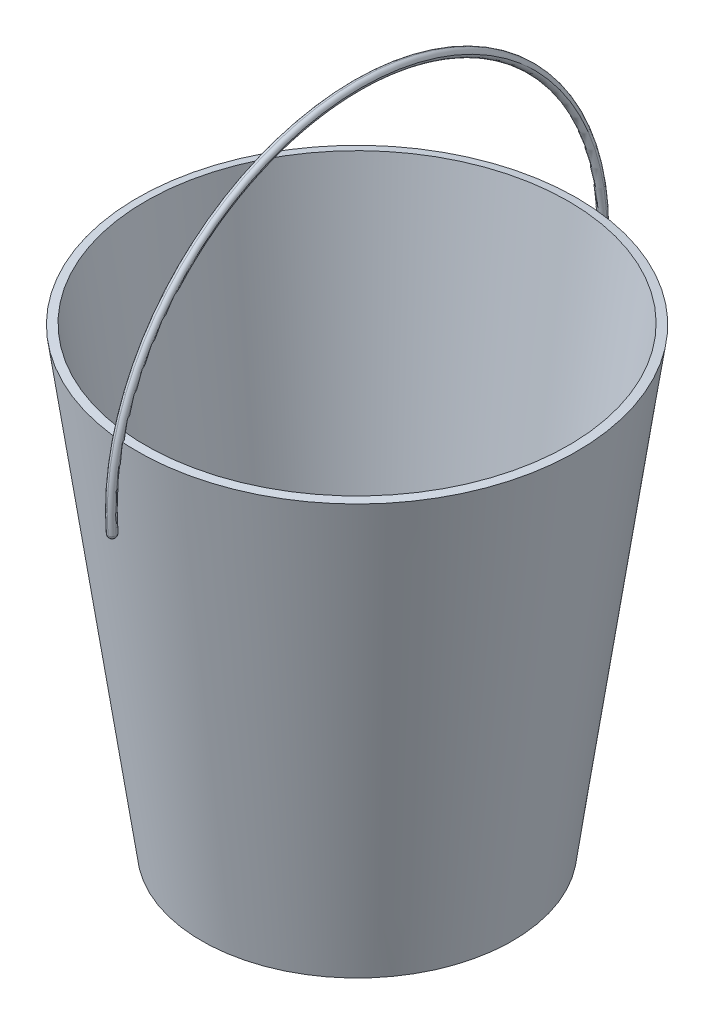
ISO-10303-21;
HEADER;
FILE_DESCRIPTION(('STEP AP214'),'2;1');
FILE_NAME('part.step','',(''),(''),'','','');
FILE_SCHEMA(('AUTOMOTIVE_DESIGN { 1 0 10303 214 1 1 1 1 }'));
ENDSEC;
DATA;
#1=APPLICATION_CONTEXT('core data for automotive mechanical design processes');
#2=APPLICATION_PROTOCOL_DEFINITION('international standard','automotive_design',2000,#1);
#3=PRODUCT_CONTEXT('',#1,'mechanical');
#4=PRODUCT('Part','Part','',(#3));
#5=PRODUCT_RELATED_PRODUCT_CATEGORY('part','',(#4));
#6=PRODUCT_DEFINITION_FORMATION('','',#4);
#7=PRODUCT_DEFINITION_CONTEXT('part definition',#1,'design');
#8=PRODUCT_DEFINITION('design','',#6,#7);
#9=PRODUCT_DEFINITION_SHAPE('','',#8);
#10=(LENGTH_UNIT() NAMED_UNIT(*) SI_UNIT(.MILLI.,.METRE.));
#11=(NAMED_UNIT(*) PLANE_ANGLE_UNIT() SI_UNIT($,.RADIAN.));
#12=(NAMED_UNIT(*) SI_UNIT($,.STERADIAN.) SOLID_ANGLE_UNIT());
#13=UNCERTAINTY_MEASURE_WITH_UNIT(LENGTH_MEASURE(1.E-05),#10,'distance_accuracy_value','');
#14=(GEOMETRIC_REPRESENTATION_CONTEXT(3) GLOBAL_UNCERTAINTY_ASSIGNED_CONTEXT((#13)) GLOBAL_UNIT_ASSIGNED_CONTEXT((#10,
#11,#12)) REPRESENTATION_CONTEXT('',''));
#15=CARTESIAN_POINT('',(0.,0.,0.));
#16=DIRECTION('',(0.,0.,1.));
#17=DIRECTION('',(1.,0.,0.));
#18=AXIS2_PLACEMENT_3D('',#15,#16,#17);
#19=CARTESIAN_POINT('',(0.,95.996142755768,-59.088151966747));
#20=DIRECTION('',(0.,0.,1.));
#21=DIRECTION('',(1.,0.,0.));
#22=AXIS2_PLACEMENT_3D('',#19,#20,#21);
#23=SPHERICAL_SURFACE('',#22,1.);
#24=CARTESIAN_POINT('',(0.,95.996142755768,-59.088151966747));
#25=DIRECTION('',(0.,-0.0965481443031342,-0.995328315598236));
#26=DIRECTION('',(0.,0.995328315598236,-0.0965481443031342));
#27=AXIS2_PLACEMENT_3D('',#24,#25,#26);
#28=CIRCLE('',#27,1.);
#29=CARTESIAN_POINT('',(0.,95.0008144401697,-58.9916038224438));
#30=VERTEX_POINT('',#29);
#31=CARTESIAN_POINT('',(1.,95.996142755768,-59.088151966747));
#32=VERTEX_POINT('',#31);
#33=EDGE_CURVE('E12',#30,#32,#28,.F.);
#34=ORIENTED_EDGE('',*,*,#33,.F.);
#35=CARTESIAN_POINT('',(0.,95.996142755768,-59.088151966747));
#36=DIRECTION('',(-1.,0.,0.));
#37=DIRECTION('',(0.,0.,1.));
#38=AXIS2_PLACEMENT_3D('',#35,#36,#37);
#39=CIRCLE('',#38,1.);
#40=CARTESIAN_POINT('',(0.,95.9163995113156,-60.0849674035076));
#41=VERTEX_POINT('',#40);
#42=EDGE_CURVE('E52',#41,#30,#39,.T.);
#43=ORIENTED_EDGE('',*,*,#42,.F.);
#44=CARTESIAN_POINT('',(0.,95.996142755768,-59.088151966747));
#45=DIRECTION('',(0.,-0.99681543676059,0.0797432444523959));
#46=DIRECTION('',(0.,-0.0797432444523959,-0.99681543676059));
#47=AXIS2_PLACEMENT_3D('',#44,#45,#46);
#48=CIRCLE('',#47,1.);
#49=EDGE_CURVE('E162',#32,#41,#48,.F.);
#50=ORIENTED_EDGE('',*,*,#49,.F.);
#51=EDGE_LOOP('',(#34,#43,#50));
#52=FACE_BOUND('',#51,.T.);
#53=ADVANCED_FACE('F44',(#52),#23,.T.);
#54=CARTESIAN_POINT('',(0.,95.9961427557679,59.088151966747));
#55=DIRECTION('',(0.,0.,1.));
#56=DIRECTION('',(1.,0.,0.));
#57=AXIS2_PLACEMENT_3D('',#54,#55,#56);
#58=SPHERICAL_SURFACE('',#57,1.);
#59=CARTESIAN_POINT('',(0.,95.9961427557679,59.088151966747));
#60=DIRECTION('',(0.,-0.996815436760591,-0.0797432444523821));
#61=DIRECTION('',(0.,0.0797432444523821,-0.996815436760591));
#62=AXIS2_PLACEMENT_3D('',#59,#60,#61);
#63=CIRCLE('',#62,1.);
#64=CARTESIAN_POINT('',(0.,95.9163995113156,60.0849674035076));
#65=VERTEX_POINT('',#64);
#66=CARTESIAN_POINT('',(1.,95.9961427557679,59.088151966747));
#67=VERTEX_POINT('',#66);
#68=EDGE_CURVE('E165',#65,#67,#63,.F.);
#69=ORIENTED_EDGE('',*,*,#68,.F.);
#70=CARTESIAN_POINT('',(0.,95.9961427557679,59.088151966747));
#71=DIRECTION('',(-1.,0.,0.));
#72=DIRECTION('',(0.,0.,1.));
#73=AXIS2_PLACEMENT_3D('',#70,#71,#72);
#74=CIRCLE('',#73,1.);
#75=CARTESIAN_POINT('',(0.,95.0008144401697,58.9916038224438));
#76=VERTEX_POINT('',#75);
#77=EDGE_CURVE('E140',#76,#65,#74,.T.);
#78=ORIENTED_EDGE('',*,*,#77,.F.);
#79=CARTESIAN_POINT('',(0.,95.9961427557679,59.088151966747));
#80=DIRECTION('',(0.,-0.0965481443031411,0.995328315598235));
#81=DIRECTION('',(0.,-0.995328315598235,-0.0965481443031411));
#82=AXIS2_PLACEMENT_3D('',#79,#80,#81);
#83=CIRCLE('',#82,1.);
#84=EDGE_CURVE('E123',#67,#76,#83,.F.);
#85=ORIENTED_EDGE('',*,*,#84,.F.);
#86=EDGE_LOOP('',(#69,#78,#85));
#87=FACE_BOUND('',#86,.T.);
#88=ADVANCED_FACE('F193',(#87),#58,.T.);
#89=CARTESIAN_POINT('',(0.,95.996142755768,-59.088151966747));
#90=DIRECTION('',(0.,0.,1.));
#91=DIRECTION('',(1.,0.,0.));
#92=AXIS2_PLACEMENT_3D('',#89,#90,#91);
#93=SPHERICAL_SURFACE('',#92,1.);
#94=ORIENTED_EDGE('',*,*,#42,.T.);
#95=CARTESIAN_POINT('',(0.,95.996142755768,-59.088151966747));
#96=DIRECTION('',(0.,0.0965481443031479,0.995328315598234));
#97=DIRECTION('',(0.,-0.995328315598235,0.096548144303148));
#98=AXIS2_PLACEMENT_3D('',#95,#96,#97);
#99=CIRCLE('',#98,1.);
#100=CARTESIAN_POINT('',(-1.,95.996142755768,-59.088151966747));
#101=VERTEX_POINT('',#100);
#102=EDGE_CURVE('E155',#101,#30,#99,.T.);
#103=ORIENTED_EDGE('',*,*,#102,.F.);
#104=CARTESIAN_POINT('',(0.,95.996142755768,-59.088151966747));
#105=DIRECTION('',(0.,-0.996815436760591,0.0797432444523821));
#106=DIRECTION('',(0.,-0.0797432444523821,-0.996815436760591));
#107=AXIS2_PLACEMENT_3D('',#104,#105,#106);
#108=CIRCLE('',#107,1.);
#109=EDGE_CURVE('E151',#41,#101,#108,.F.);
#110=ORIENTED_EDGE('',*,*,#109,.F.);
#111=EDGE_LOOP('',(#94,#103,#110));
#112=FACE_BOUND('',#111,.T.);
#113=ADVANCED_FACE('F170',(#112),#93,.T.);
#114=CARTESIAN_POINT('',(0.,100.723076923077,0.));
#115=DIRECTION('',(1.,0.,0.));
#116=DIRECTION('',(0.,0.,-1.));
#117=AXIS2_PLACEMENT_3D('',#114,#115,#116);
#118=TOROIDAL_SURFACE('',#117,59.2769230769231,1.);
#119=CARTESIAN_POINT('',(1.,100.723076923077,0.));
#120=DIRECTION('',(1.,0.,0.));
#121=DIRECTION('',(0.,0.,-1.));
#122=AXIS2_PLACEMENT_3D('',#119,#120,#121);
#123=CIRCLE('',#122,59.2769230769231);
#124=EDGE_CURVE('E107',#32,#67,#123,.T.);
#125=ORIENTED_EDGE('',*,*,#124,.F.);
#126=ORIENTED_EDGE('',*,*,#49,.T.);
#127=CARTESIAN_POINT('',(0.,100.723076923077,0.));
#128=DIRECTION('',(1.,0.,0.));
#129=DIRECTION('',(0.,0.,-1.));
#130=AXIS2_PLACEMENT_3D('',#127,#128,#129);
#131=CIRCLE('',#130,60.2769230769231);
#132=EDGE_CURVE('E147',#65,#41,#131,.F.);
#133=ORIENTED_EDGE('',*,*,#132,.F.);
#134=ORIENTED_EDGE('',*,*,#68,.T.);
#135=EDGE_LOOP('',(#125,#126,#133,#134));
#136=FACE_BOUND('',#135,.T.);
#137=ADVANCED_FACE('F177',(#136),#118,.T.);
#138=CARTESIAN_POINT('',(0.,95.996142755768,-59.088151966747));
#139=DIRECTION('',(0.,0.,1.));
#140=DIRECTION('',(1.,0.,0.));
#141=AXIS2_PLACEMENT_3D('',#138,#139,#140);
#142=SPHERICAL_SURFACE('',#141,1.);
#143=CARTESIAN_POINT('',(0.,95.996142755768,-59.088151966747));
#144=DIRECTION('',(1.,0.,0.));
#145=DIRECTION('',(0.,0.,-1.));
#146=AXIS2_PLACEMENT_3D('',#143,#144,#145);
#147=CIRCLE('',#146,1.);
#148=CARTESIAN_POINT('',(0.,96.0758860002204,-58.0913365299864));
#149=VERTEX_POINT('',#148);
#150=EDGE_CURVE('E159',#149,#30,#147,.T.);
#151=ORIENTED_EDGE('',*,*,#150,.T.);
#152=ORIENTED_EDGE('',*,*,#33,.T.);
#153=CARTESIAN_POINT('',(0.,95.996142755768,-59.088151966747));
#154=DIRECTION('',(0.,-0.996815436760589,0.0797432444524091));
#155=DIRECTION('',(0.,-0.0797432444524091,-0.996815436760589));
#156=AXIS2_PLACEMENT_3D('',#153,#154,#155);
#157=CIRCLE('',#156,1.);
#158=EDGE_CURVE('E100',#149,#32,#157,.F.);
#159=ORIENTED_EDGE('',*,*,#158,.F.);
#160=EDGE_LOOP('',(#151,#152,#159));
#161=FACE_BOUND('',#160,.T.);
#162=ADVANCED_FACE('F180',(#161),#142,.T.);
#163=CARTESIAN_POINT('',(0.,95.996142755768,-59.088151966747));
#164=DIRECTION('',(0.,0.,1.));
#165=DIRECTION('',(1.,0.,0.));
#166=AXIS2_PLACEMENT_3D('',#163,#164,#165);
#167=SPHERICAL_SURFACE('',#166,1.);
#168=ORIENTED_EDGE('',*,*,#102,.T.);
#169=ORIENTED_EDGE('',*,*,#150,.F.);
#170=CARTESIAN_POINT('',(0.,95.996142755768,-59.088151966747));
#171=DIRECTION('',(0.,-0.99681543676059,0.0797432444523959));
#172=DIRECTION('',(0.,-0.0797432444523959,-0.99681543676059));
#173=AXIS2_PLACEMENT_3D('',#170,#171,#172);
#174=CIRCLE('',#173,1.);
#175=EDGE_CURVE('E96',#101,#149,#174,.F.);
#176=ORIENTED_EDGE('',*,*,#175,.F.);
#177=EDGE_LOOP('',(#168,#169,#176));
#178=FACE_BOUND('',#177,.T.);
#179=ADVANCED_FACE('F182',(#178),#167,.T.);
#180=CARTESIAN_POINT('',(0.,100.723076923077,0.));
#181=DIRECTION('',(1.,0.,0.));
#182=DIRECTION('',(0.,0.,-1.));
#183=AXIS2_PLACEMENT_3D('',#180,#181,#182);
#184=TOROIDAL_SURFACE('',#183,59.2769230769231,1.);
#185=CARTESIAN_POINT('',(0.,95.9961427557679,59.088151966747));
#186=DIRECTION('',(0.,-0.99681543676059,-0.0797432444523959));
#187=DIRECTION('',(0.,0.0797432444523959,-0.99681543676059));
#188=AXIS2_PLACEMENT_3D('',#185,#186,#187);
#189=CIRCLE('',#188,1.);
#190=CARTESIAN_POINT('',(-1.,95.9961427557679,59.088151966747));
#191=VERTEX_POINT('',#190);
#192=EDGE_CURVE('E144',#65,#191,#189,.T.);
#193=ORIENTED_EDGE('',*,*,#192,.F.);
#194=ORIENTED_EDGE('',*,*,#132,.T.);
#195=ORIENTED_EDGE('',*,*,#109,.T.);
#196=CARTESIAN_POINT('',(-1.,100.723076923077,0.));
#197=DIRECTION('',(1.,0.,0.));
#198=DIRECTION('',(0.,0.,-1.));
#199=AXIS2_PLACEMENT_3D('',#196,#197,#198);
#200=CIRCLE('',#199,59.2769230769231);
#201=EDGE_CURVE('E130',#191,#101,#200,.F.);
#202=ORIENTED_EDGE('',*,*,#201,.F.);
#203=EDGE_LOOP('',(#193,#194,#195,#202));
#204=FACE_BOUND('',#203,.T.);
#205=ADVANCED_FACE('F175',(#204),#184,.T.);
#206=CARTESIAN_POINT('',(0.,95.9961427557679,59.088151966747));
#207=DIRECTION('',(0.,0.,1.));
#208=DIRECTION('',(1.,0.,0.));
#209=AXIS2_PLACEMENT_3D('',#206,#207,#208);
#210=SPHERICAL_SURFACE('',#209,1.);
#211=ORIENTED_EDGE('',*,*,#77,.T.);
#212=ORIENTED_EDGE('',*,*,#192,.T.);
#213=CARTESIAN_POINT('',(0.,95.9961427557679,59.088151966747));
#214=DIRECTION('',(0.,-0.0965481443031411,0.995328315598235));
#215=DIRECTION('',(0.,-0.995328315598235,-0.0965481443031411));
#216=AXIS2_PLACEMENT_3D('',#213,#214,#215);
#217=CIRCLE('',#216,1.);
#218=EDGE_CURVE('E112',#76,#191,#217,.F.);
#219=ORIENTED_EDGE('',*,*,#218,.F.);
#220=EDGE_LOOP('',(#211,#212,#219));
#221=FACE_BOUND('',#220,.T.);
#222=ADVANCED_FACE('F189',(#221),#210,.T.);
#223=CARTESIAN_POINT('',(0.,100.723076923077,0.));
#224=DIRECTION('',(1.,0.,0.));
#225=DIRECTION('',(0.,0.,-1.));
#226=AXIS2_PLACEMENT_3D('',#223,#224,#225);
#227=TOROIDAL_SURFACE('',#226,59.2769230769231,1.);
#228=CARTESIAN_POINT('',(0.,100.723076923077,0.));
#229=DIRECTION('',(1.,0.,0.));
#230=DIRECTION('',(0.,0.,-1.));
#231=AXIS2_PLACEMENT_3D('',#228,#229,#230);
#232=CIRCLE('',#231,58.2769230769231);
#233=CARTESIAN_POINT('',(0.,96.0758860002204,58.0913365299864));
#234=VERTEX_POINT('',#233);
#235=EDGE_CURVE('E88',#149,#234,#232,.T.);
#236=ORIENTED_EDGE('',*,*,#235,.F.);
#237=ORIENTED_EDGE('',*,*,#158,.T.);
#238=ORIENTED_EDGE('',*,*,#124,.T.);
#239=CARTESIAN_POINT('',(0.,95.9961427557679,59.088151966747));
#240=DIRECTION('',(0.,-0.99681543676059,-0.0797432444523959));
#241=DIRECTION('',(0.,0.0797432444523959,-0.99681543676059));
#242=AXIS2_PLACEMENT_3D('',#239,#240,#241);
#243=CIRCLE('',#242,1.);
#244=EDGE_CURVE('E104',#234,#67,#243,.T.);
#245=ORIENTED_EDGE('',*,*,#244,.F.);
#246=EDGE_LOOP('',(#236,#237,#238,#245));
#247=FACE_BOUND('',#246,.T.);
#248=ADVANCED_FACE('F105',(#247),#227,.T.);
#249=CARTESIAN_POINT('',(0.,100.723076923077,0.));
#250=DIRECTION('',(1.,0.,0.));
#251=DIRECTION('',(0.,0.,-1.));
#252=AXIS2_PLACEMENT_3D('',#249,#250,#251);
#253=TOROIDAL_SURFACE('',#252,59.2769230769231,1.);
#254=ORIENTED_EDGE('',*,*,#175,.T.);
#255=ORIENTED_EDGE('',*,*,#235,.T.);
#256=CARTESIAN_POINT('',(0.,95.9961427557679,59.088151966747));
#257=DIRECTION('',(0.,-0.996815436760589,-0.0797432444524102));
#258=DIRECTION('',(0.,0.0797432444524102,-0.996815436760589));
#259=AXIS2_PLACEMENT_3D('',#256,#257,#258);
#260=CIRCLE('',#259,1.);
#261=EDGE_CURVE('E93',#191,#234,#260,.T.);
#262=ORIENTED_EDGE('',*,*,#261,.F.);
#263=ORIENTED_EDGE('',*,*,#201,.T.);
#264=EDGE_LOOP('',(#254,#255,#262,#263));
#265=FACE_BOUND('',#264,.T.);
#266=ADVANCED_FACE('F90',(#265),#253,.T.);
#267=CARTESIAN_POINT('',(0.,95.9961427557679,59.088151966747));
#268=DIRECTION('',(0.,0.,1.));
#269=DIRECTION('',(1.,0.,0.));
#270=AXIS2_PLACEMENT_3D('',#267,#268,#269);
#271=SPHERICAL_SURFACE('',#270,1.);
#272=ORIENTED_EDGE('',*,*,#244,.T.);
#273=ORIENTED_EDGE('',*,*,#84,.T.);
#274=CARTESIAN_POINT('',(0.,95.9961427557679,59.088151966747));
#275=DIRECTION('',(1.,0.,0.));
#276=DIRECTION('',(0.,0.,-1.));
#277=AXIS2_PLACEMENT_3D('',#274,#275,#276);
#278=CIRCLE('',#277,1.);
#279=EDGE_CURVE('E117',#234,#76,#278,.F.);
#280=ORIENTED_EDGE('',*,*,#279,.F.);
#281=EDGE_LOOP('',(#272,#273,#280));
#282=FACE_BOUND('',#281,.T.);
#283=ADVANCED_FACE('F121',(#282),#271,.T.);
#284=CARTESIAN_POINT('',(0.,95.9961427557679,59.088151966747));
#285=DIRECTION('',(0.,0.,1.));
#286=DIRECTION('',(1.,0.,0.));
#287=AXIS2_PLACEMENT_3D('',#284,#285,#286);
#288=SPHERICAL_SURFACE('',#287,1.);
#289=ORIENTED_EDGE('',*,*,#218,.T.);
#290=ORIENTED_EDGE('',*,*,#261,.T.);
#291=ORIENTED_EDGE('',*,*,#279,.T.);
#292=EDGE_LOOP('',(#289,#290,#291));
#293=FACE_BOUND('',#292,.T.);
#294=ADVANCED_FACE('F116',(#293),#288,.T.);
#295=CLOSED_SHELL('',(#53,#88,#113,#137,#162,#179,#205,#222,#248,#266,#283,#294));
#296=MANIFOLD_SOLID_BREP('B2',#295);
#297=CARTESIAN_POINT('',(0.,0.,0.));
#298=DIRECTION('',(0.,-1.,0.));
#299=DIRECTION('',(0.,0.,-1.));
#300=AXIS2_PLACEMENT_3D('',#297,#298,#299);
#301=PLANE('',#300);
#302=CARTESIAN_POINT('',(0.,0.,0.));
#303=DIRECTION('',(0.,-1.,0.));
#304=DIRECTION('',(0.,0.,-1.));
#305=AXIS2_PLACEMENT_3D('',#302,#303,#304);
#306=CIRCLE('',#305,37.5);
#307=CARTESIAN_POINT('',(0.,0.,-37.5));
#308=VERTEX_POINT('',#307);
#309=EDGE_CURVE('E43',#308,#308,#306,.T.);
#310=ORIENTED_EDGE('',*,*,#309,.T.);
#311=EDGE_LOOP('',(#310));
#312=FACE_BOUND('',#311,.T.);
#313=ADVANCED_FACE('F295',(#312),#301,.T.);
#314=CARTESIAN_POINT('',(0.,0.,0.));
#315=DIRECTION('',(0.,1.,0.));
#316=DIRECTION('',(0.,0.,1.));
#317=AXIS2_PLACEMENT_3D('',#314,#315,#316);
#318=CONICAL_SURFACE('',#317,37.5,0.139987445213081);
#319=CARTESIAN_POINT('',(0.,110.,0.));
#320=DIRECTION('',(0.,-1.,0.));
#321=DIRECTION('',(0.,0.,-1.));
#322=AXIS2_PLACEMENT_3D('',#319,#320,#321);
#323=CIRCLE('',#322,53.);
#324=CARTESIAN_POINT('',(0.,110.,-53.));
#325=VERTEX_POINT('',#324);
#326=EDGE_CURVE('E302',#325,#325,#323,.T.);
#327=ORIENTED_EDGE('',*,*,#326,.T.);
#328=EDGE_LOOP('',(#327));
#329=FACE_BOUND('',#328,.T.);
#330=ORIENTED_EDGE('',*,*,#309,.F.);
#331=EDGE_LOOP('',(#330));
#332=FACE_BOUND('',#331,.T.);
#333=ADVANCED_FACE('F331',(#329,#332),#318,.T.);
#334=CARTESIAN_POINT('',(0.,110.,0.));
#335=DIRECTION('',(0.,-1.,0.));
#336=DIRECTION('',(0.,0.,-1.));
#337=AXIS2_PLACEMENT_3D('',#334,#335,#336);
#338=CONICAL_SURFACE('',#337,53.,1.43080888158182);
#339=CARTESIAN_POINT('',(0.,110.279061365365,0.));
#340=DIRECTION('',(0.,-1.,0.));
#341=DIRECTION('',(0.,0.,-1.));
#342=AXIS2_PLACEMENT_3D('',#339,#340,#341);
#343=CIRCLE('',#342,51.0195645038627);
#344=CARTESIAN_POINT('',(0.,110.279061365365,-51.0195645038627));
#345=VERTEX_POINT('',#344);
#346=EDGE_CURVE('E309',#345,#345,#343,.T.);
#347=ORIENTED_EDGE('',*,*,#346,.T.);
#348=EDGE_LOOP('',(#347));
#349=FACE_BOUND('',#348,.T.);
#350=ORIENTED_EDGE('',*,*,#326,.F.);
#351=EDGE_LOOP('',(#350));
#352=FACE_BOUND('',#351,.T.);
#353=ADVANCED_FACE('F328',(#349,#352),#338,.T.);
#354=CARTESIAN_POINT('',(0.,110.279061365365,0.));
#355=DIRECTION('',(0.,1.,0.));
#356=DIRECTION('',(0.,0.,1.));
#357=AXIS2_PLACEMENT_3D('',#354,#355,#356);
#358=CONICAL_SURFACE('',#357,51.0195645038627,0.139987445213081);
#359=CARTESIAN_POINT('',(0.,2.,0.));
#360=DIRECTION('',(0.,-1.,0.));
#361=DIRECTION('',(0.,0.,-1.));
#362=AXIS2_PLACEMENT_3D('',#359,#360,#361);
#363=CIRCLE('',#362,35.7620604023794);
#364=CARTESIAN_POINT('',(0.,2.,-35.7620604023794));
#365=VERTEX_POINT('',#364);
#366=EDGE_CURVE('E313',#365,#365,#363,.T.);
#367=ORIENTED_EDGE('',*,*,#366,.T.);
#368=EDGE_LOOP('',(#367));
#369=FACE_BOUND('',#368,.T.);
#370=ORIENTED_EDGE('',*,*,#346,.F.);
#371=EDGE_LOOP('',(#370));
#372=FACE_BOUND('',#371,.T.);
#373=ADVANCED_FACE('F319',(#369,#372),#358,.F.);
#374=CARTESIAN_POINT('',(0.,2.,0.));
#375=DIRECTION('',(0.,1.,0.));
#376=DIRECTION('',(0.,0.,1.));
#377=AXIS2_PLACEMENT_3D('',#374,#375,#376);
#378=PLANE('',#377);
#379=ORIENTED_EDGE('',*,*,#366,.F.);
#380=EDGE_LOOP('',(#379));
#381=FACE_BOUND('',#380,.T.);
#382=ADVANCED_FACE('F322',(#381),#378,.T.);
#383=CLOSED_SHELL('',(#313,#333,#353,#373,#382));
#384=MANIFOLD_SOLID_BREP('B6',#383);
#385=ADVANCED_BREP_SHAPE_REPRESENTATION('',(#18,#296,#384),#14);
#386=SHAPE_DEFINITION_REPRESENTATION(#9,#385);
ENDSEC;
END-ISO-10303-21;
